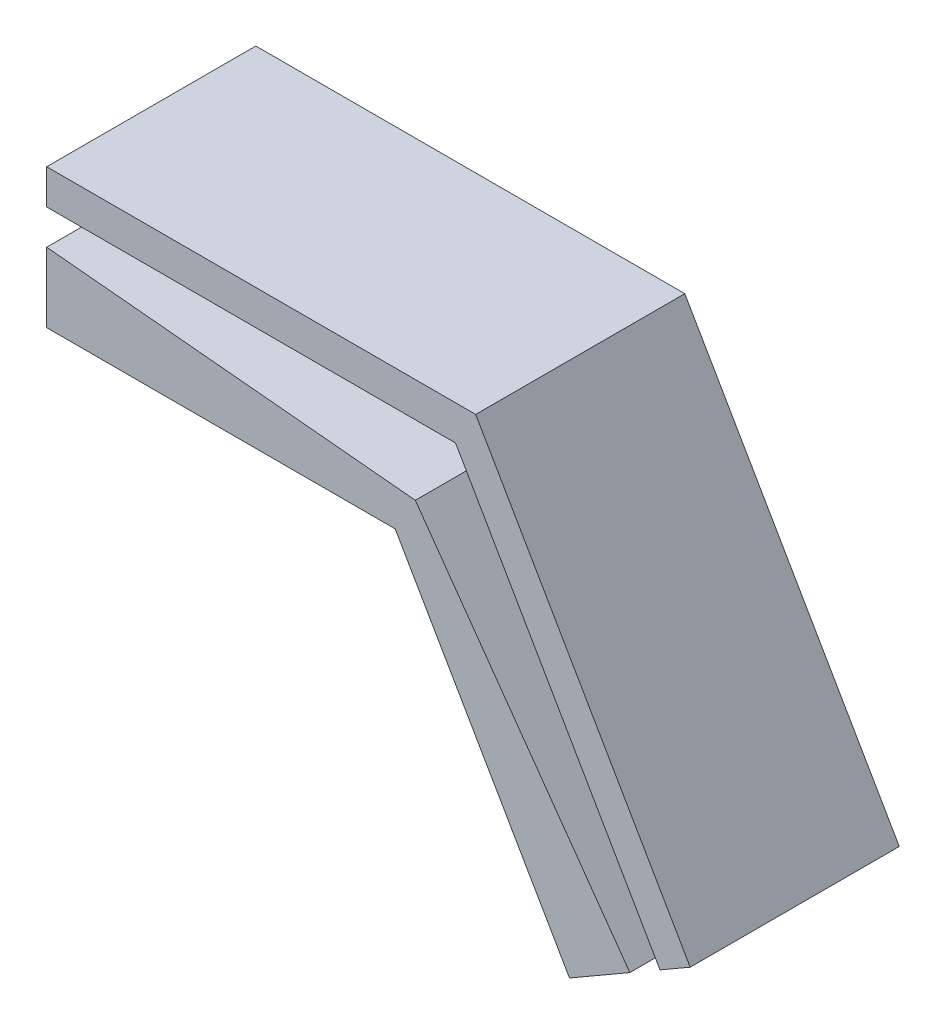
ISO-10303-21;
HEADER;
FILE_DESCRIPTION(('STEP AP214'),'2;1');
FILE_NAME('part.step','',(''),(''),'','','');
FILE_SCHEMA(('AUTOMOTIVE_DESIGN { 1 0 10303 214 1 1 1 1 }'));
ENDSEC;
DATA;
#1=APPLICATION_CONTEXT('core data for automotive mechanical design processes');
#2=APPLICATION_PROTOCOL_DEFINITION('international standard','automotive_design',2000,#1);
#3=PRODUCT_CONTEXT('',#1,'mechanical');
#4=PRODUCT('Part','Part','',(#3));
#5=PRODUCT_RELATED_PRODUCT_CATEGORY('part','',(#4));
#6=PRODUCT_DEFINITION_FORMATION('','',#4);
#7=PRODUCT_DEFINITION_CONTEXT('part definition',#1,'design');
#8=PRODUCT_DEFINITION('design','',#6,#7);
#9=PRODUCT_DEFINITION_SHAPE('','',#8);
#10=(LENGTH_UNIT() NAMED_UNIT(*) SI_UNIT(.MILLI.,.METRE.));
#11=(NAMED_UNIT(*) PLANE_ANGLE_UNIT() SI_UNIT($,.RADIAN.));
#12=(NAMED_UNIT(*) SI_UNIT($,.STERADIAN.) SOLID_ANGLE_UNIT());
#13=UNCERTAINTY_MEASURE_WITH_UNIT(LENGTH_MEASURE(1.E-05),#10,'distance_accuracy_value','');
#14=(GEOMETRIC_REPRESENTATION_CONTEXT(3) GLOBAL_UNCERTAINTY_ASSIGNED_CONTEXT((#13)) GLOBAL_UNIT_ASSIGNED_CONTEXT((#10,
#11,#12)) REPRESENTATION_CONTEXT('',''));
#15=CARTESIAN_POINT('',(0.,0.,0.));
#16=DIRECTION('',(0.,0.,1.));
#17=DIRECTION('',(1.,0.,0.));
#18=AXIS2_PLACEMENT_3D('',#15,#16,#17);
#19=CARTESIAN_POINT('',(0.,0.,6.));
#20=DIRECTION('',(0.,0.,1.));
#21=DIRECTION('',(1.,0.,0.));
#22=AXIS2_PLACEMENT_3D('',#19,#20,#21);
#23=PLANE('',#22);
#24=DIRECTION('',(-1.,0.,0.));
#25=VECTOR('',#24,1.);
#26=CARTESIAN_POINT('',(-111.668383112431,38.923858732916,6.));
#27=LINE('',#26,#25);
#28=CARTESIAN_POINT('',(-99.9363323048624,38.923858732916,6.));
#29=VERTEX_POINT('',#28);
#30=CARTESIAN_POINT('',(-111.668383112431,38.923858732916,6.));
#31=VERTEX_POINT('',#30);
#32=EDGE_CURVE('E202',#29,#31,#27,.T.);
#33=ORIENTED_EDGE('',*,*,#32,.F.);
#34=DIRECTION('',(-0.500000000000001,0.866025403784438,0.));
#35=VECTOR('',#34,1.);
#36=CARTESIAN_POINT('',(-94.070306901078,28.7636046950716,6.));
#37=LINE('',#36,#35);
#38=CARTESIAN_POINT('',(-94.070306901078,28.7636046950716,6.));
#39=VERTEX_POINT('',#38);
#40=EDGE_CURVE('E112',#39,#29,#37,.T.);
#41=ORIENTED_EDGE('',*,*,#40,.F.);
#42=DIRECTION('',(0.866025403784438,0.500000000000001,0.));
#43=VECTOR('',#42,1.);
#44=CARTESIAN_POINT('',(-96.6683831124313,27.2636046950716,6.));
#45=LINE('',#44,#43);
#46=CARTESIAN_POINT('',(-93.2042814972935,29.2636046950716,6.));
#47=VERTEX_POINT('',#46);
#48=EDGE_CURVE('E104',#39,#47,#45,.T.);
#49=ORIENTED_EDGE('',*,*,#48,.T.);
#50=DIRECTION('',(-0.500000000000001,0.866025403784438,0.));
#51=VECTOR('',#50,1.);
#52=CARTESIAN_POINT('',(-93.2042814972935,29.2636046950716,6.));
#53=LINE('',#52,#51);
#54=CARTESIAN_POINT('',(-99.3589820356728,39.923858732916,6.));
#55=VERTEX_POINT('',#54);
#56=EDGE_CURVE('E108',#47,#55,#53,.T.);
#57=ORIENTED_EDGE('',*,*,#56,.T.);
#58=DIRECTION('',(-1.,0.,0.));
#59=VECTOR('',#58,1.);
#60=CARTESIAN_POINT('',(-99.3589820356728,39.923858732916,6.));
#61=LINE('',#60,#59);
#62=CARTESIAN_POINT('',(-111.668383112431,39.923858732916,6.));
#63=VERTEX_POINT('',#62);
#64=EDGE_CURVE('E57',#55,#63,#61,.T.);
#65=ORIENTED_EDGE('',*,*,#64,.T.);
#66=DIRECTION('',(0.,-1.,0.));
#67=VECTOR('',#66,1.);
#68=CARTESIAN_POINT('',(-111.668383112431,35.923858732916,6.));
#69=LINE('',#68,#67);
#70=EDGE_CURVE('E165',#63,#31,#69,.T.);
#71=ORIENTED_EDGE('',*,*,#70,.T.);
#72=EDGE_LOOP('',(#33,#41,#49,#57,#65,#71));
#73=FACE_BOUND('',#72,.T.);
#74=ADVANCED_FACE('F33',(#73),#23,.T.);
#75=CARTESIAN_POINT('',(-111.668383112431,35.923858732916,6.));
#76=DIRECTION('',(1.,0.,0.));
#77=DIRECTION('',(0.,0.,-1.));
#78=AXIS2_PLACEMENT_3D('',#75,#76,#77);
#79=PLANE('',#78);
#80=CARTESIAN_POINT('',(-111.668383112431,37.923858732916,6.));
#81=VERTEX_POINT('',#80);
#82=CARTESIAN_POINT('',(-111.668383112431,35.923858732916,6.));
#83=VERTEX_POINT('',#82);
#84=EDGE_CURVE('E92',#81,#83,#69,.T.);
#85=ORIENTED_EDGE('',*,*,#84,.F.);
#86=DIRECTION('',(0.,0.,1.));
#87=VECTOR('',#86,1.);
#88=CARTESIAN_POINT('',(-111.668383112431,37.923858732916,1.));
#89=LINE('',#88,#87);
#90=CARTESIAN_POINT('',(-111.668383112431,37.923858732916,1.));
#91=VERTEX_POINT('',#90);
#92=EDGE_CURVE('E140',#91,#81,#89,.T.);
#93=ORIENTED_EDGE('',*,*,#92,.F.);
#94=DIRECTION('',(0.,-1.,0.));
#95=VECTOR('',#94,1.);
#96=CARTESIAN_POINT('',(-111.668383112431,37.923858732916,1.));
#97=LINE('',#96,#95);
#98=CARTESIAN_POINT('',(-111.668383112431,38.923858732916,1.));
#99=VERTEX_POINT('',#98);
#100=EDGE_CURVE('E196',#99,#91,#97,.T.);
#101=ORIENTED_EDGE('',*,*,#100,.F.);
#102=DIRECTION('',(0.,0.,1.));
#103=VECTOR('',#102,1.);
#104=CARTESIAN_POINT('',(-111.668383112431,38.923858732916,1.));
#105=LINE('',#104,#103);
#106=EDGE_CURVE('E169',#99,#31,#105,.T.);
#107=ORIENTED_EDGE('',*,*,#106,.T.);
#108=ORIENTED_EDGE('',*,*,#70,.F.);
#109=DIRECTION('',(0.,0.,-1.));
#110=VECTOR('',#109,1.);
#111=CARTESIAN_POINT('',(-111.668383112431,39.923858732916,6.));
#112=LINE('',#111,#110);
#113=CARTESIAN_POINT('',(-111.668383112431,39.923858732916,0.));
#114=VERTEX_POINT('',#113);
#115=EDGE_CURVE('E131',#63,#114,#112,.T.);
#116=ORIENTED_EDGE('',*,*,#115,.T.);
#117=DIRECTION('',(0.,-1.,0.));
#118=VECTOR('',#117,1.);
#119=CARTESIAN_POINT('',(-111.668383112431,35.923858732916,0.));
#120=LINE('',#119,#118);
#121=CARTESIAN_POINT('',(-111.668383112431,35.923858732916,0.));
#122=VERTEX_POINT('',#121);
#123=EDGE_CURVE('E136',#114,#122,#120,.T.);
#124=ORIENTED_EDGE('',*,*,#123,.T.);
#125=DIRECTION('',(0.,0.,-1.));
#126=VECTOR('',#125,1.);
#127=CARTESIAN_POINT('',(-111.668383112431,35.923858732916,6.));
#128=LINE('',#127,#126);
#129=EDGE_CURVE('E11',#83,#122,#128,.T.);
#130=ORIENTED_EDGE('',*,*,#129,.F.);
#131=EDGE_LOOP('',(#85,#93,#101,#107,#108,#116,#124,#130));
#132=FACE_BOUND('',#131,.T.);
#133=ADVANCED_FACE('F35',(#132),#79,.F.);
#134=CARTESIAN_POINT('',(-111.668383112431,35.923858732916,6.));
#135=DIRECTION('',(0.,1.,0.));
#136=DIRECTION('',(0.,0.,1.));
#137=AXIS2_PLACEMENT_3D('',#134,#135,#136);
#138=PLANE('',#137);
#139=DIRECTION('',(1.,0.,0.));
#140=VECTOR('',#139,1.);
#141=CARTESIAN_POINT('',(-111.668383112431,35.923858732916,0.));
#142=LINE('',#141,#140);
#143=CARTESIAN_POINT('',(-101.668383112431,35.923858732916,0.));
#144=VERTEX_POINT('',#143);
#145=EDGE_CURVE('E139',#122,#144,#142,.T.);
#146=ORIENTED_EDGE('',*,*,#145,.T.);
#147=DIRECTION('',(0.,0.,-1.));
#148=VECTOR('',#147,1.);
#149=CARTESIAN_POINT('',(-101.668383112431,35.923858732916,6.));
#150=LINE('',#149,#148);
#151=CARTESIAN_POINT('',(-101.668383112431,35.923858732916,6.));
#152=VERTEX_POINT('',#151);
#153=EDGE_CURVE('E41',#152,#144,#150,.T.);
#154=ORIENTED_EDGE('',*,*,#153,.F.);
#155=DIRECTION('',(1.,0.,0.));
#156=VECTOR('',#155,1.);
#157=CARTESIAN_POINT('',(-111.668383112431,35.923858732916,6.));
#158=LINE('',#157,#156);
#159=EDGE_CURVE('E170',#83,#152,#158,.T.);
#160=ORIENTED_EDGE('',*,*,#159,.F.);
#161=ORIENTED_EDGE('',*,*,#129,.T.);
#162=EDGE_LOOP('',(#146,#154,#160,#161));
#163=FACE_BOUND('',#162,.T.);
#164=ADVANCED_FACE('F248',(#163),#138,.F.);
#165=CARTESIAN_POINT('',(-101.668383112431,35.923858732916,6.));
#166=DIRECTION('',(0.866025403784438,0.500000000000002,0.));
#167=DIRECTION('',(-0.500000000000002,0.866025403784438,0.));
#168=AXIS2_PLACEMENT_3D('',#165,#166,#167);
#169=PLANE('',#168);
#170=DIRECTION('',(0.500000000000001,-0.866025403784438,0.));
#171=VECTOR('',#170,1.);
#172=CARTESIAN_POINT('',(-101.668383112431,35.923858732916,0.));
#173=LINE('',#172,#171);
#174=CARTESIAN_POINT('',(-96.6683831124313,27.2636046950716,0.));
#175=VERTEX_POINT('',#174);
#176=EDGE_CURVE('E142',#144,#175,#173,.T.);
#177=ORIENTED_EDGE('',*,*,#176,.T.);
#178=DIRECTION('',(0.,0.,-1.));
#179=VECTOR('',#178,1.);
#180=CARTESIAN_POINT('',(-96.6683831124313,27.2636046950716,6.));
#181=LINE('',#180,#179);
#182=CARTESIAN_POINT('',(-96.6683831124313,27.2636046950716,6.));
#183=VERTEX_POINT('',#182);
#184=EDGE_CURVE('E126',#183,#175,#181,.T.);
#185=ORIENTED_EDGE('',*,*,#184,.F.);
#186=DIRECTION('',(0.500000000000001,-0.866025403784438,0.));
#187=VECTOR('',#186,1.);
#188=CARTESIAN_POINT('',(-101.668383112431,35.923858732916,6.));
#189=LINE('',#188,#187);
#190=EDGE_CURVE('E116',#152,#183,#189,.T.);
#191=ORIENTED_EDGE('',*,*,#190,.F.);
#192=ORIENTED_EDGE('',*,*,#153,.T.);
#193=EDGE_LOOP('',(#177,#185,#191,#192));
#194=FACE_BOUND('',#193,.T.);
#195=ADVANCED_FACE('F155',(#194),#169,.F.);
#196=CARTESIAN_POINT('',(-96.6683831124313,27.2636046950716,6.));
#197=DIRECTION('',(-0.500000000000001,0.866025403784438,0.));
#198=DIRECTION('',(-0.866025403784438,-0.500000000000001,0.));
#199=AXIS2_PLACEMENT_3D('',#196,#197,#198);
#200=PLANE('',#199);
#201=ORIENTED_EDGE('',*,*,#48,.F.);
#202=DIRECTION('',(0.,0.,1.));
#203=VECTOR('',#202,1.);
#204=CARTESIAN_POINT('',(-94.070306901078,28.7636046950716,1.));
#205=LINE('',#204,#203);
#206=CARTESIAN_POINT('',(-94.070306901078,28.7636046950716,1.));
#207=VERTEX_POINT('',#206);
#208=EDGE_CURVE('E192',#207,#39,#205,.T.);
#209=ORIENTED_EDGE('',*,*,#208,.F.);
#210=DIRECTION('',(0.866025403784438,0.500000000000001,0.));
#211=VECTOR('',#210,1.);
#212=CARTESIAN_POINT('',(-94.9363323048624,28.2636046950716,1.));
#213=LINE('',#212,#211);
#214=CARTESIAN_POINT('',(-94.9363323048624,28.2636046950716,1.));
#215=VERTEX_POINT('',#214);
#216=EDGE_CURVE('E186',#215,#207,#213,.T.);
#217=ORIENTED_EDGE('',*,*,#216,.F.);
#218=DIRECTION('',(0.,0.,1.));
#219=VECTOR('',#218,1.);
#220=CARTESIAN_POINT('',(-94.9363323048624,28.2636046950716,1.));
#221=LINE('',#220,#219);
#222=CARTESIAN_POINT('',(-94.9363323048624,28.2636046950716,6.));
#223=VERTEX_POINT('',#222);
#224=EDGE_CURVE('E183',#215,#223,#221,.T.);
#225=ORIENTED_EDGE('',*,*,#224,.T.);
#226=EDGE_CURVE('E115',#183,#223,#45,.T.);
#227=ORIENTED_EDGE('',*,*,#226,.F.);
#228=ORIENTED_EDGE('',*,*,#184,.T.);
#229=DIRECTION('',(0.866025403784438,0.500000000000001,0.));
#230=VECTOR('',#229,1.);
#231=CARTESIAN_POINT('',(-96.6683831124313,27.2636046950716,0.));
#232=LINE('',#231,#230);
#233=CARTESIAN_POINT('',(-93.2042814972935,29.2636046950716,0.));
#234=VERTEX_POINT('',#233);
#235=EDGE_CURVE('E123',#175,#234,#232,.T.);
#236=ORIENTED_EDGE('',*,*,#235,.T.);
#237=DIRECTION('',(0.,0.,-1.));
#238=VECTOR('',#237,1.);
#239=CARTESIAN_POINT('',(-93.2042814972935,29.2636046950716,6.));
#240=LINE('',#239,#238);
#241=EDGE_CURVE('E119',#47,#234,#240,.T.);
#242=ORIENTED_EDGE('',*,*,#241,.F.);
#243=EDGE_LOOP('',(#201,#209,#217,#225,#227,#228,#236,#242));
#244=FACE_BOUND('',#243,.T.);
#245=ADVANCED_FACE('F120',(#244),#200,.F.);
#246=CARTESIAN_POINT('',(-93.2042814972935,29.2636046950716,6.));
#247=DIRECTION('',(-0.866025403784438,-0.500000000000001,0.));
#248=DIRECTION('',(0.500000000000001,-0.866025403784438,0.));
#249=AXIS2_PLACEMENT_3D('',#246,#247,#248);
#250=PLANE('',#249);
#251=DIRECTION('',(-0.500000000000001,0.866025403784438,0.));
#252=VECTOR('',#251,1.);
#253=CARTESIAN_POINT('',(-93.2042814972935,29.2636046950716,0.));
#254=LINE('',#253,#252);
#255=CARTESIAN_POINT('',(-99.3589820356728,39.923858732916,0.));
#256=VERTEX_POINT('',#255);
#257=EDGE_CURVE('E145',#234,#256,#254,.T.);
#258=ORIENTED_EDGE('',*,*,#257,.T.);
#259=DIRECTION('',(0.,0.,-1.));
#260=VECTOR('',#259,1.);
#261=CARTESIAN_POINT('',(-99.3589820356728,39.923858732916,6.));
#262=LINE('',#261,#260);
#263=EDGE_CURVE('E127',#55,#256,#262,.T.);
#264=ORIENTED_EDGE('',*,*,#263,.F.);
#265=ORIENTED_EDGE('',*,*,#56,.F.);
#266=ORIENTED_EDGE('',*,*,#241,.T.);
#267=EDGE_LOOP('',(#258,#264,#265,#266));
#268=FACE_BOUND('',#267,.T.);
#269=ADVANCED_FACE('F129',(#268),#250,.F.);
#270=CARTESIAN_POINT('',(-99.3589820356728,39.923858732916,6.));
#271=DIRECTION('',(0.,-1.,0.));
#272=DIRECTION('',(1.,0.,0.));
#273=AXIS2_PLACEMENT_3D('',#270,#271,#272);
#274=PLANE('',#273);
#275=DIRECTION('',(-1.,0.,0.));
#276=VECTOR('',#275,1.);
#277=CARTESIAN_POINT('',(-99.3589820356728,39.923858732916,0.));
#278=LINE('',#277,#276);
#279=EDGE_CURVE('E84',#256,#114,#278,.T.);
#280=ORIENTED_EDGE('',*,*,#279,.T.);
#281=ORIENTED_EDGE('',*,*,#115,.F.);
#282=ORIENTED_EDGE('',*,*,#64,.F.);
#283=ORIENTED_EDGE('',*,*,#263,.T.);
#284=EDGE_LOOP('',(#280,#281,#282,#283));
#285=FACE_BOUND('',#284,.T.);
#286=ADVANCED_FACE('F161',(#285),#274,.F.);
#287=DIRECTION('',(0.995560676860035,-0.0941219352222848,0.));
#288=VECTOR('',#287,1.);
#289=CARTESIAN_POINT('',(-101.091032843242,36.9238587329159,6.));
#290=LINE('',#289,#288);
#291=CARTESIAN_POINT('',(-101.091032843242,36.9238587329159,6.));
#292=VERTEX_POINT('',#291);
#293=EDGE_CURVE('E48',#81,#292,#290,.T.);
#294=ORIENTED_EDGE('',*,*,#293,.F.);
#295=ORIENTED_EDGE('',*,*,#84,.T.);
#296=ORIENTED_EDGE('',*,*,#159,.T.);
#297=ORIENTED_EDGE('',*,*,#190,.T.);
#298=ORIENTED_EDGE('',*,*,#226,.T.);
#299=DIRECTION('',(0.579292325385868,-0.81511986955848,0.));
#300=VECTOR('',#299,1.);
#301=CARTESIAN_POINT('',(-101.091032843242,36.9238587329159,6.));
#302=LINE('',#301,#300);
#303=EDGE_CURVE('E207',#292,#223,#302,.T.);
#304=ORIENTED_EDGE('',*,*,#303,.F.);
#305=EDGE_LOOP('',(#294,#295,#296,#297,#298,#304));
#306=FACE_BOUND('',#305,.T.);
#307=ADVANCED_FACE('F176',(#306),#23,.T.);
#308=CARTESIAN_POINT('',(0.,0.,0.));
#309=DIRECTION('',(0.,0.,1.));
#310=DIRECTION('',(1.,0.,0.));
#311=AXIS2_PLACEMENT_3D('',#308,#309,#310);
#312=PLANE('',#311);
#313=ORIENTED_EDGE('',*,*,#123,.F.);
#314=ORIENTED_EDGE('',*,*,#279,.F.);
#315=ORIENTED_EDGE('',*,*,#257,.F.);
#316=ORIENTED_EDGE('',*,*,#235,.F.);
#317=ORIENTED_EDGE('',*,*,#176,.F.);
#318=ORIENTED_EDGE('',*,*,#145,.F.);
#319=EDGE_LOOP('',(#313,#314,#315,#316,#317,#318));
#320=FACE_BOUND('',#319,.T.);
#321=ADVANCED_FACE('F160',(#320),#312,.F.);
#322=CARTESIAN_POINT('',(-101.091032843242,36.9238587329159,1.));
#323=DIRECTION('',(-0.0941219352222849,-0.995560676860036,0.));
#324=DIRECTION('',(0.995560676860036,-0.0941219352222849,0.));
#325=AXIS2_PLACEMENT_3D('',#322,#323,#324);
#326=PLANE('',#325);
#327=ORIENTED_EDGE('',*,*,#293,.T.);
#328=DIRECTION('',(0.,0.,1.));
#329=VECTOR('',#328,1.);
#330=CARTESIAN_POINT('',(-101.091032843242,36.9238587329159,1.));
#331=LINE('',#330,#329);
#332=CARTESIAN_POINT('',(-101.091032843242,36.9238587329159,1.));
#333=VERTEX_POINT('',#332);
#334=EDGE_CURVE('E174',#333,#292,#331,.T.);
#335=ORIENTED_EDGE('',*,*,#334,.F.);
#336=DIRECTION('',(0.995560676860035,-0.0941219352222848,0.));
#337=VECTOR('',#336,1.);
#338=CARTESIAN_POINT('',(-101.091032843242,36.9238587329159,1.));
#339=LINE('',#338,#337);
#340=EDGE_CURVE('E205',#91,#333,#339,.T.);
#341=ORIENTED_EDGE('',*,*,#340,.F.);
#342=ORIENTED_EDGE('',*,*,#92,.T.);
#343=EDGE_LOOP('',(#327,#335,#341,#342));
#344=FACE_BOUND('',#343,.T.);
#345=ADVANCED_FACE('F228',(#344),#326,.F.);
#346=CARTESIAN_POINT('',(-111.668383112431,38.923858732916,1.));
#347=DIRECTION('',(0.,1.,0.));
#348=DIRECTION('',(0.,0.,1.));
#349=AXIS2_PLACEMENT_3D('',#346,#347,#348);
#350=PLANE('',#349);
#351=ORIENTED_EDGE('',*,*,#32,.T.);
#352=ORIENTED_EDGE('',*,*,#106,.F.);
#353=DIRECTION('',(-1.,0.,0.));
#354=VECTOR('',#353,1.);
#355=CARTESIAN_POINT('',(-111.668383112431,38.923858732916,1.));
#356=LINE('',#355,#354);
#357=CARTESIAN_POINT('',(-99.9363323048624,38.923858732916,1.));
#358=VERTEX_POINT('',#357);
#359=EDGE_CURVE('E212',#358,#99,#356,.T.);
#360=ORIENTED_EDGE('',*,*,#359,.F.);
#361=DIRECTION('',(0.,0.,1.));
#362=VECTOR('',#361,1.);
#363=CARTESIAN_POINT('',(-99.9363323048624,38.923858732916,1.));
#364=LINE('',#363,#362);
#365=EDGE_CURVE('E194',#358,#29,#364,.T.);
#366=ORIENTED_EDGE('',*,*,#365,.T.);
#367=EDGE_LOOP('',(#351,#352,#360,#366));
#368=FACE_BOUND('',#367,.T.);
#369=ADVANCED_FACE('F238',(#368),#350,.F.);
#370=CARTESIAN_POINT('',(-94.070306901078,28.7636046950716,1.));
#371=DIRECTION('',(0.866025403784438,0.500000000000001,0.));
#372=DIRECTION('',(-0.500000000000001,0.866025403784438,0.));
#373=AXIS2_PLACEMENT_3D('',#370,#371,#372);
#374=PLANE('',#373);
#375=ORIENTED_EDGE('',*,*,#40,.T.);
#376=ORIENTED_EDGE('',*,*,#365,.F.);
#377=DIRECTION('',(-0.500000000000001,0.866025403784438,0.));
#378=VECTOR('',#377,1.);
#379=CARTESIAN_POINT('',(-94.070306901078,28.7636046950716,1.));
#380=LINE('',#379,#378);
#381=EDGE_CURVE('E215',#207,#358,#380,.T.);
#382=ORIENTED_EDGE('',*,*,#381,.F.);
#383=ORIENTED_EDGE('',*,*,#208,.T.);
#384=EDGE_LOOP('',(#375,#376,#382,#383));
#385=FACE_BOUND('',#384,.T.);
#386=ADVANCED_FACE('F243',(#385),#374,.F.);
#387=CARTESIAN_POINT('',(-101.091032843242,36.9238587329159,1.));
#388=DIRECTION('',(-0.81511986955848,-0.579292325385868,0.));
#389=DIRECTION('',(0.579292325385868,-0.81511986955848,0.));
#390=AXIS2_PLACEMENT_3D('',#387,#388,#389);
#391=PLANE('',#390);
#392=ORIENTED_EDGE('',*,*,#303,.T.);
#393=ORIENTED_EDGE('',*,*,#224,.F.);
#394=DIRECTION('',(0.579292325385868,-0.81511986955848,0.));
#395=VECTOR('',#394,1.);
#396=CARTESIAN_POINT('',(-101.091032843242,36.9238587329159,1.));
#397=LINE('',#396,#395);
#398=EDGE_CURVE('E219',#333,#215,#397,.T.);
#399=ORIENTED_EDGE('',*,*,#398,.F.);
#400=ORIENTED_EDGE('',*,*,#334,.T.);
#401=EDGE_LOOP('',(#392,#393,#399,#400));
#402=FACE_BOUND('',#401,.T.);
#403=ADVANCED_FACE('F335',(#402),#391,.F.);
#404=CARTESIAN_POINT('',(0.,0.,1.));
#405=DIRECTION('',(0.,0.,-1.));
#406=DIRECTION('',(-1.,0.,0.));
#407=AXIS2_PLACEMENT_3D('',#404,#405,#406);
#408=PLANE('',#407);
#409=ORIENTED_EDGE('',*,*,#340,.T.);
#410=ORIENTED_EDGE('',*,*,#398,.T.);
#411=ORIENTED_EDGE('',*,*,#216,.T.);
#412=ORIENTED_EDGE('',*,*,#381,.T.);
#413=ORIENTED_EDGE('',*,*,#359,.T.);
#414=ORIENTED_EDGE('',*,*,#100,.T.);
#415=EDGE_LOOP('',(#409,#410,#411,#412,#413,#414));
#416=FACE_BOUND('',#415,.T.);
#417=ADVANCED_FACE('F225',(#416),#408,.F.);
#418=CLOSED_SHELL('',(#74,#133,#164,#195,#245,#269,#286,#307,#321,#345,#369,#386,#403,#417));
#419=MANIFOLD_SOLID_BREP('B2',#418);
#420=ADVANCED_BREP_SHAPE_REPRESENTATION('',(#18,#419),#14);
#421=SHAPE_DEFINITION_REPRESENTATION(#9,#420);
ENDSEC;
END-ISO-10303-21;
